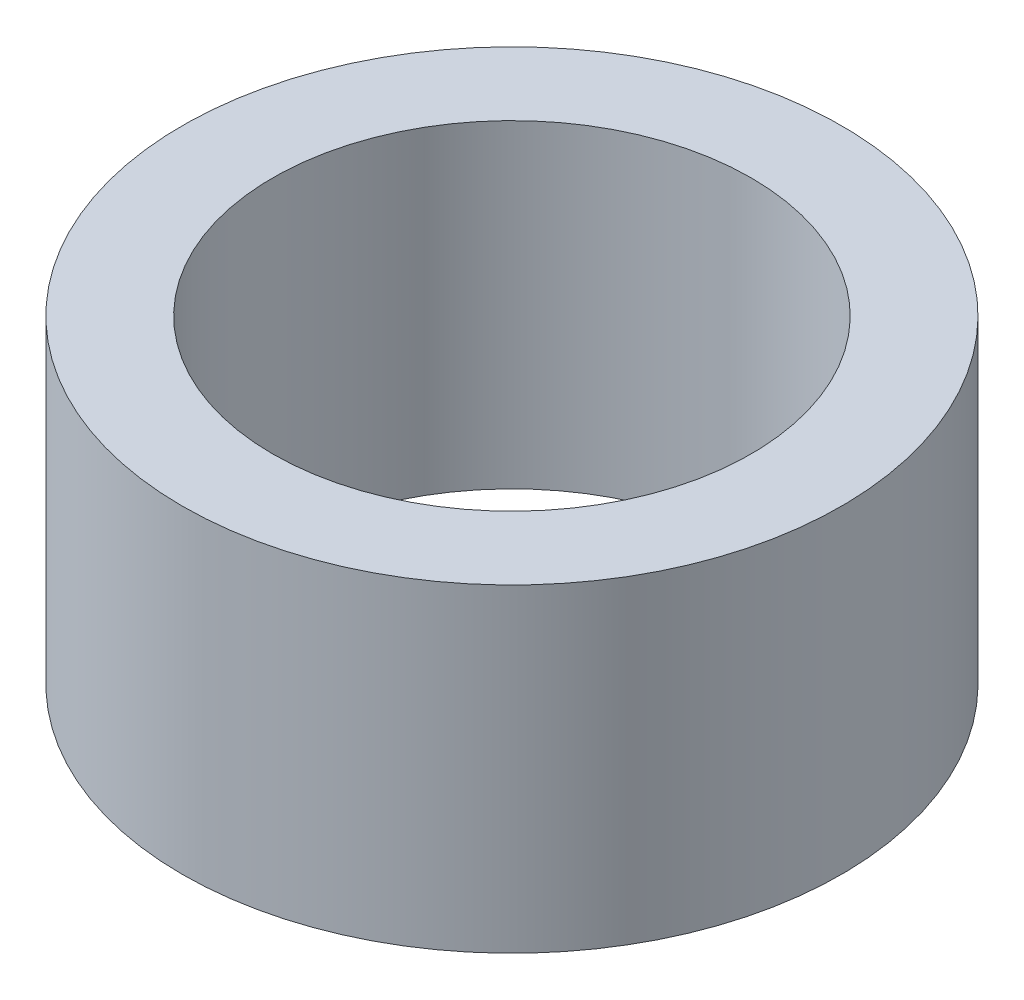
ISO-10303-21;
HEADER;
FILE_DESCRIPTION(('STEP AP214'),'2;1');
FILE_NAME('part.step','',(''),(''),'','','');
FILE_SCHEMA(('AUTOMOTIVE_DESIGN { 1 0 10303 214 1 1 1 1 }'));
ENDSEC;
DATA;
#1=APPLICATION_CONTEXT('core data for automotive mechanical design processes');
#2=APPLICATION_PROTOCOL_DEFINITION('international standard','automotive_design',2000,#1);
#3=PRODUCT_CONTEXT('',#1,'mechanical');
#4=PRODUCT('Part','Part','',(#3));
#5=PRODUCT_RELATED_PRODUCT_CATEGORY('part','',(#4));
#6=PRODUCT_DEFINITION_FORMATION('','',#4);
#7=PRODUCT_DEFINITION_CONTEXT('part definition',#1,'design');
#8=PRODUCT_DEFINITION('design','',#6,#7);
#9=PRODUCT_DEFINITION_SHAPE('','',#8);
#10=(LENGTH_UNIT() NAMED_UNIT(*) SI_UNIT(.MILLI.,.METRE.));
#11=(NAMED_UNIT(*) PLANE_ANGLE_UNIT() SI_UNIT($,.RADIAN.));
#12=(NAMED_UNIT(*) SI_UNIT($,.STERADIAN.) SOLID_ANGLE_UNIT());
#13=UNCERTAINTY_MEASURE_WITH_UNIT(LENGTH_MEASURE(1.E-05),#10,'distance_accuracy_value','');
#14=(GEOMETRIC_REPRESENTATION_CONTEXT(3) GLOBAL_UNCERTAINTY_ASSIGNED_CONTEXT((#13)) GLOBAL_UNIT_ASSIGNED_CONTEXT((#10,
#11,#12)) REPRESENTATION_CONTEXT('',''));
#15=CARTESIAN_POINT('',(0.,0.,0.));
#16=DIRECTION('',(0.,0.,1.));
#17=DIRECTION('',(1.,0.,0.));
#18=AXIS2_PLACEMENT_3D('',#15,#16,#17);
#19=CARTESIAN_POINT('',(0.,3.,0.));
#20=DIRECTION('',(0.,1.,0.));
#21=DIRECTION('',(0.,0.,1.));
#22=AXIS2_PLACEMENT_3D('',#19,#20,#21);
#23=PLANE('',#22);
#24=CARTESIAN_POINT('',(0.,3.,0.));
#25=DIRECTION('',(0.,1.,0.));
#26=DIRECTION('',(0.,0.,1.));
#27=AXIS2_PLACEMENT_3D('',#24,#25,#26);
#28=CIRCLE('',#27,3.1);
#29=CARTESIAN_POINT('',(0.,3.,3.1));
#30=VERTEX_POINT('',#29);
#31=EDGE_CURVE('E11',#30,#30,#28,.T.);
#32=ORIENTED_EDGE('',*,*,#31,.T.);
#33=EDGE_LOOP('',(#32));
#34=FACE_BOUND('',#33,.T.);
#35=CARTESIAN_POINT('',(0.,3.,0.));
#36=DIRECTION('',(0.,1.,0.));
#37=DIRECTION('',(0.,0.,1.));
#38=AXIS2_PLACEMENT_3D('',#35,#36,#37);
#39=CIRCLE('',#38,2.25);
#40=CARTESIAN_POINT('',(0.,3.,2.25));
#41=VERTEX_POINT('',#40);
#42=EDGE_CURVE('E57',#41,#41,#39,.T.);
#43=ORIENTED_EDGE('',*,*,#42,.F.);
#44=EDGE_LOOP('',(#43));
#45=FACE_BOUND('',#44,.T.);
#46=ADVANCED_FACE('F44',(#34,#45),#23,.T.);
#47=CARTESIAN_POINT('',(0.,0.,0.));
#48=DIRECTION('',(0.,1.,0.));
#49=DIRECTION('',(0.,0.,1.));
#50=AXIS2_PLACEMENT_3D('',#47,#48,#49);
#51=PLANE('',#50);
#52=CARTESIAN_POINT('',(0.,0.,0.));
#53=DIRECTION('',(0.,1.,0.));
#54=DIRECTION('',(0.,0.,1.));
#55=AXIS2_PLACEMENT_3D('',#52,#53,#54);
#56=CIRCLE('',#55,3.1);
#57=CARTESIAN_POINT('',(0.,0.,3.1));
#58=VERTEX_POINT('',#57);
#59=EDGE_CURVE('E48',#58,#58,#56,.T.);
#60=ORIENTED_EDGE('',*,*,#59,.F.);
#61=EDGE_LOOP('',(#60));
#62=FACE_BOUND('',#61,.T.);
#63=CARTESIAN_POINT('',(0.,0.,0.));
#64=DIRECTION('',(0.,1.,0.));
#65=DIRECTION('',(0.,0.,1.));
#66=AXIS2_PLACEMENT_3D('',#63,#64,#65);
#67=CIRCLE('',#66,2.25);
#68=CARTESIAN_POINT('',(0.,0.,2.25));
#69=VERTEX_POINT('',#68);
#70=EDGE_CURVE('E60',#69,#69,#67,.T.);
#71=ORIENTED_EDGE('',*,*,#70,.T.);
#72=EDGE_LOOP('',(#71));
#73=FACE_BOUND('',#72,.T.);
#74=ADVANCED_FACE('F72',(#62,#73),#51,.F.);
#75=CARTESIAN_POINT('',(0.,3.,0.));
#76=DIRECTION('',(0.,-1.,0.));
#77=DIRECTION('',(0.,0.,-1.));
#78=AXIS2_PLACEMENT_3D('',#75,#76,#77);
#79=CYLINDRICAL_SURFACE('',#78,3.1);
#80=ORIENTED_EDGE('',*,*,#31,.F.);
#81=EDGE_LOOP('',(#80));
#82=FACE_BOUND('',#81,.T.);
#83=ORIENTED_EDGE('',*,*,#59,.T.);
#84=EDGE_LOOP('',(#83));
#85=FACE_BOUND('',#84,.T.);
#86=ADVANCED_FACE('F46',(#82,#85),#79,.T.);
#87=CARTESIAN_POINT('',(0.,3.,0.));
#88=DIRECTION('',(0.,-1.,0.));
#89=DIRECTION('',(0.,0.,-1.));
#90=AXIS2_PLACEMENT_3D('',#87,#88,#89);
#91=CYLINDRICAL_SURFACE('',#90,2.25);
#92=ORIENTED_EDGE('',*,*,#42,.T.);
#93=EDGE_LOOP('',(#92));
#94=FACE_BOUND('',#93,.T.);
#95=ORIENTED_EDGE('',*,*,#70,.F.);
#96=EDGE_LOOP('',(#95));
#97=FACE_BOUND('',#96,.T.);
#98=ADVANCED_FACE('F68',(#94,#97),#91,.F.);
#99=CLOSED_SHELL('',(#46,#74,#86,#98));
#100=MANIFOLD_SOLID_BREP('B2',#99);
#101=ADVANCED_BREP_SHAPE_REPRESENTATION('',(#18,#100),#14);
#102=SHAPE_DEFINITION_REPRESENTATION(#9,#101);
ENDSEC;
END-ISO-10303-21;
